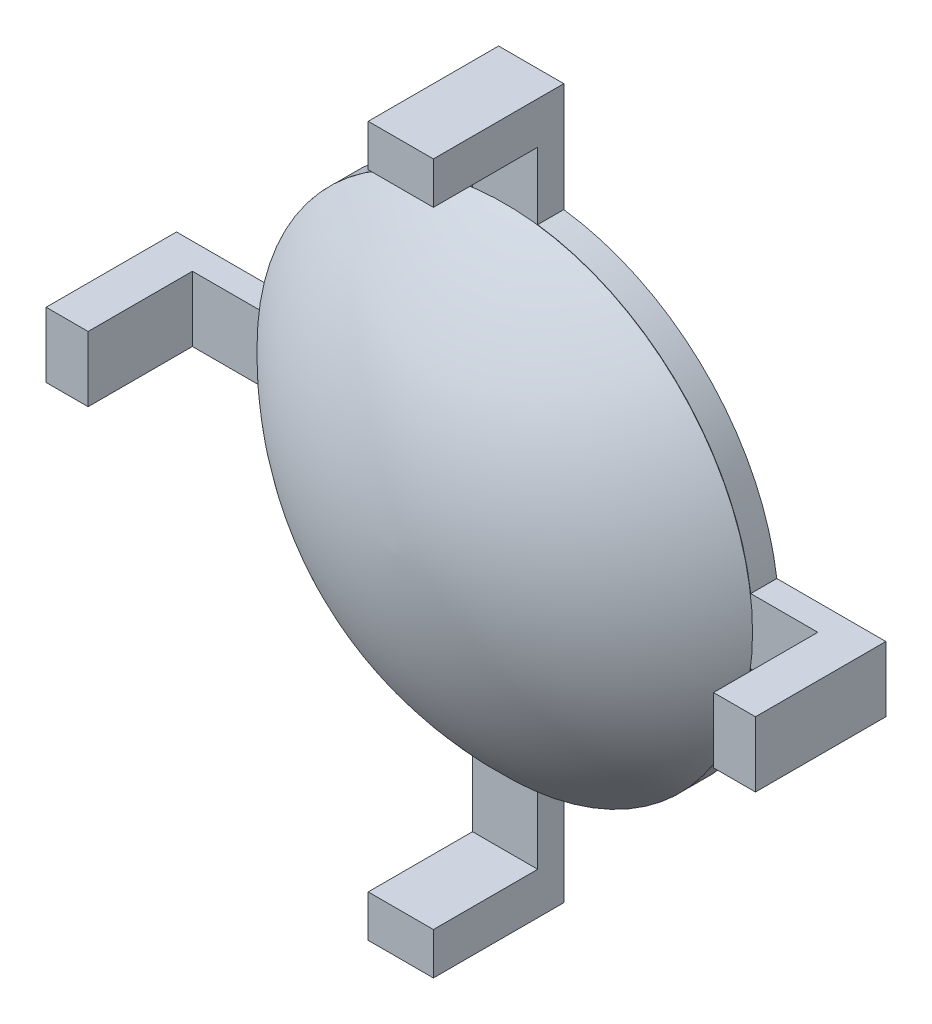
ISO-10303-21;
HEADER;
FILE_DESCRIPTION(('STEP AP214'),'2;1');
FILE_NAME('part.step','',(''),(''),'','','');
FILE_SCHEMA(('AUTOMOTIVE_DESIGN { 1 0 10303 214 1 1 1 1 }'));
ENDSEC;
DATA;
#1=APPLICATION_CONTEXT('core data for automotive mechanical design processes');
#2=APPLICATION_PROTOCOL_DEFINITION('international standard','automotive_design',2000,#1);
#3=PRODUCT_CONTEXT('',#1,'mechanical');
#4=PRODUCT('Part','Part','',(#3));
#5=PRODUCT_RELATED_PRODUCT_CATEGORY('part','',(#4));
#6=PRODUCT_DEFINITION_FORMATION('','',#4);
#7=PRODUCT_DEFINITION_CONTEXT('part definition',#1,'design');
#8=PRODUCT_DEFINITION('design','',#6,#7);
#9=PRODUCT_DEFINITION_SHAPE('','',#8);
#10=(LENGTH_UNIT() NAMED_UNIT(*) SI_UNIT(.MILLI.,.METRE.));
#11=(NAMED_UNIT(*) PLANE_ANGLE_UNIT() SI_UNIT($,.RADIAN.));
#12=(NAMED_UNIT(*) SI_UNIT($,.STERADIAN.) SOLID_ANGLE_UNIT());
#13=UNCERTAINTY_MEASURE_WITH_UNIT(LENGTH_MEASURE(1.E-05),#10,'distance_accuracy_value','');
#14=(GEOMETRIC_REPRESENTATION_CONTEXT(3) GLOBAL_UNCERTAINTY_ASSIGNED_CONTEXT((#13)) GLOBAL_UNIT_ASSIGNED_CONTEXT((#10,
#11,#12)) REPRESENTATION_CONTEXT('',''));
#15=CARTESIAN_POINT('',(0.,0.,0.));
#16=DIRECTION('',(0.,0.,1.));
#17=DIRECTION('',(1.,0.,0.));
#18=AXIS2_PLACEMENT_3D('',#15,#16,#17);
#19=CARTESIAN_POINT('',(0.,0.,1.01190134481042));
#20=DIRECTION('',(0.,0.,-1.));
#21=DIRECTION('',(-1.,0.,0.));
#22=AXIS2_PLACEMENT_3D('',#19,#20,#21);
#23=PLANE('',#22);
#24=CARTESIAN_POINT('',(-0.000156815590813585,0.,1.01190134481041));
#25=DIRECTION('',(0.,0.,-1.));
#26=DIRECTION('',(-1.,0.,0.));
#27=AXIS2_PLACEMENT_3D('',#24,#25,#26);
#28=CIRCLE('',#27,9.49999999999999);
#29=CARTESIAN_POINT('',(-9.5001568155908,0.,1.01190134481044));
#30=VERTEX_POINT('',#29);
#31=EDGE_CURVE('E13',#30,#30,#28,.T.);
#32=ORIENTED_EDGE('',*,*,#31,.T.);
#33=EDGE_LOOP('',(#32));
#34=FACE_BOUND('',#33,.T.);
#35=ADVANCED_FACE('F103',(#34),#23,.T.);
#36=CARTESIAN_POINT('',(0.321275749167376,0.,-8.35919612309495));
#37=DIRECTION('',(0.,-1.,0.));
#38=DIRECTION('',(-1.,0.,0.));
#39=AXIS2_PLACEMENT_3D('',#36,#37,#38);
#40=CIRCLE('',#39,13.5749035126249);
#41=TRIMMED_CURVE('',#40,(PARAMETER_VALUE(-1.54711567166305)),
(PARAMETER_VALUE(1.54711567166305)),.T.,.PARAMETER.);
#42=CARTESIAN_POINT('',(-0.000156815590845745,0.,-8.35919612309495));
#43=DIRECTION('',(0.,0.,-1.));
#44=AXIS1_PLACEMENT('',#42,#43);
#45=SURFACE_OF_REVOLUTION('',#41,#44);
#46=CARTESIAN_POINT('',(-0.000156815590799178,0.,5.21190134481044));
#47=VERTEX_POINT('',#46);
#48=VERTEX_LOOP('',#47);
#49=FACE_BOUND('',#48,.T.);
#50=ORIENTED_EDGE('',*,*,#31,.F.);
#51=EDGE_LOOP('',(#50));
#52=FACE_BOUND('',#51,.T.);
#53=ADVANCED_FACE('F111',(#49,#52),#45,.T.);
#54=CLOSED_SHELL('',(#35,#53));
#55=MANIFOLD_SOLID_BREP('B2',#54);
#56=CARTESIAN_POINT('',(0.,0.,1.));
#57=DIRECTION('',(0.,0.,1.));
#58=DIRECTION('',(1.,0.,0.));
#59=AXIS2_PLACEMENT_3D('',#56,#57,#58);
#60=PLANE('',#59);
#61=DIRECTION('',(0.,1.,0.));
#62=VECTOR('',#61,1.);
#63=CARTESIAN_POINT('',(-1.25000000000014,-13.6,1.));
#64=LINE('',#63,#62);
#65=CARTESIAN_POINT('',(-1.25000000000013,-11.9906023516351,1.));
#66=VERTEX_POINT('',#65);
#67=CARTESIAN_POINT('',(-1.2500000000001,-9.41740410091867,1.));
#68=VERTEX_POINT('',#67);
#69=EDGE_CURVE('E309',#66,#68,#64,.T.);
#70=ORIENTED_EDGE('',*,*,#69,.F.);
#71=DIRECTION('',(-1.,0.,0.));
#72=VECTOR('',#71,1.);
#73=CARTESIAN_POINT('',(-1.25000000000012,-11.9906023516351,1.));
#74=LINE('',#73,#72);
#75=CARTESIAN_POINT('',(1.24999999999988,-11.9906023516351,1.));
#76=VERTEX_POINT('',#75);
#77=EDGE_CURVE('E298',#76,#66,#74,.T.);
#78=ORIENTED_EDGE('',*,*,#77,.F.);
#79=DIRECTION('',(0.,1.,0.));
#80=VECTOR('',#79,1.);
#81=CARTESIAN_POINT('',(1.24999999999986,-13.6,1.));
#82=LINE('',#81,#80);
#83=CARTESIAN_POINT('',(1.2499999999999,-9.4174041009187,1.));
#84=VERTEX_POINT('',#83);
#85=EDGE_CURVE('E306',#76,#84,#82,.T.);
#86=ORIENTED_EDGE('',*,*,#85,.T.);
#87=CARTESIAN_POINT('',(0.,0.,1.));
#88=DIRECTION('',(0.,0.,1.));
#89=DIRECTION('',(1.,0.,0.));
#90=AXIS2_PLACEMENT_3D('',#87,#88,#89);
#91=CIRCLE('',#90,9.5);
#92=CARTESIAN_POINT('',(9.41740410091868,-1.25,1.));
#93=VERTEX_POINT('',#92);
#94=EDGE_CURVE('E351',#84,#93,#91,.T.);
#95=ORIENTED_EDGE('',*,*,#94,.T.);
#96=DIRECTION('',(1.,0.,0.));
#97=VECTOR('',#96,1.);
#98=CARTESIAN_POINT('',(0.,-1.25,1.));
#99=LINE('',#98,#97);
#100=CARTESIAN_POINT('',(11.9906023516351,-1.25,1.));
#101=VERTEX_POINT('',#100);
#102=EDGE_CURVE('E387',#93,#101,#99,.T.);
#103=ORIENTED_EDGE('',*,*,#102,.T.);
#104=DIRECTION('',(0.,-1.,0.));
#105=VECTOR('',#104,1.);
#106=CARTESIAN_POINT('',(11.9906023516351,-1.25000000000008,1.));
#107=LINE('',#106,#105);
#108=CARTESIAN_POINT('',(11.9906023516351,1.25,1.));
#109=VERTEX_POINT('',#108);
#110=EDGE_CURVE('E156',#109,#101,#107,.T.);
#111=ORIENTED_EDGE('',*,*,#110,.F.);
#112=DIRECTION('',(1.,0.,0.));
#113=VECTOR('',#112,1.);
#114=CARTESIAN_POINT('',(0.,1.25,1.));
#115=LINE('',#114,#113);
#116=CARTESIAN_POINT('',(9.41740410091868,1.25,1.));
#117=VERTEX_POINT('',#116);
#118=EDGE_CURVE('E382',#117,#109,#115,.T.);
#119=ORIENTED_EDGE('',*,*,#118,.F.);
#120=CARTESIAN_POINT('',(1.2500000000001,9.41740410091867,1.));
#121=VERTEX_POINT('',#120);
#122=EDGE_CURVE('E354',#117,#121,#91,.T.);
#123=ORIENTED_EDGE('',*,*,#122,.T.);
#124=CARTESIAN_POINT('',(1.25000000000004,11.9906023516351,1.));
#125=VERTEX_POINT('',#124);
#126=EDGE_CURVE('E318',#121,#125,#82,.T.);
#127=ORIENTED_EDGE('',*,*,#126,.T.);
#128=DIRECTION('',(1.,0.,0.));
#129=VECTOR('',#128,1.);
#130=CARTESIAN_POINT('',(1.25000000000004,11.9906023516351,1.));
#131=LINE('',#130,#129);
#132=CARTESIAN_POINT('',(-1.24999999999996,11.9906023516351,1.));
#133=VERTEX_POINT('',#132);
#134=EDGE_CURVE('E451',#133,#125,#131,.T.);
#135=ORIENTED_EDGE('',*,*,#134,.F.);
#136=CARTESIAN_POINT('',(-1.2499999999999,9.4174041009187,1.));
#137=VERTEX_POINT('',#136);
#138=EDGE_CURVE('E317',#137,#133,#64,.T.);
#139=ORIENTED_EDGE('',*,*,#138,.F.);
#140=CARTESIAN_POINT('',(-9.41740410091868,1.25,1.));
#141=VERTEX_POINT('',#140);
#142=EDGE_CURVE('E355',#137,#141,#91,.T.);
#143=ORIENTED_EDGE('',*,*,#142,.T.);
#144=DIRECTION('',(1.,0.,0.));
#145=VECTOR('',#144,1.);
#146=CARTESIAN_POINT('',(0.,1.25,1.));
#147=LINE('',#146,#145);
#148=CARTESIAN_POINT('',(-11.9906023516351,1.25,1.));
#149=VERTEX_POINT('',#148);
#150=EDGE_CURVE('E412',#149,#141,#147,.T.);
#151=ORIENTED_EDGE('',*,*,#150,.F.);
#152=DIRECTION('',(0.,1.,0.));
#153=VECTOR('',#152,1.);
#154=CARTESIAN_POINT('',(-11.9906023516351,1.25,1.));
#155=LINE('',#154,#153);
#156=CARTESIAN_POINT('',(-11.9906023516351,-1.25,1.));
#157=VERTEX_POINT('',#156);
#158=EDGE_CURVE('E453',#157,#149,#155,.T.);
#159=ORIENTED_EDGE('',*,*,#158,.F.);
#160=DIRECTION('',(1.,0.,0.));
#161=VECTOR('',#160,1.);
#162=CARTESIAN_POINT('',(0.,-1.25,1.));
#163=LINE('',#162,#161);
#164=CARTESIAN_POINT('',(-9.41740410091868,-1.25,1.));
#165=VERTEX_POINT('',#164);
#166=EDGE_CURVE('E407',#157,#165,#163,.T.);
#167=ORIENTED_EDGE('',*,*,#166,.T.);
#168=EDGE_CURVE('E353',#165,#68,#91,.T.);
#169=ORIENTED_EDGE('',*,*,#168,.T.);
#170=EDGE_LOOP('',(#70,#78,#86,#95,#103,#111,#119,#123,#127,#135,#139,#143,#151,#159,#167,#169));
#171=FACE_BOUND('',#170,.T.);
#172=ADVANCED_FACE('F131',(#171),#60,.T.);
#173=CARTESIAN_POINT('',(0.,1.25,1.));
#174=DIRECTION('',(0.,1.,0.));
#175=DIRECTION('',(-1.,0.,0.));
#176=AXIS2_PLACEMENT_3D('',#173,#174,#175);
#177=PLANE('',#176);
#178=DIRECTION('',(1.,0.,0.));
#179=VECTOR('',#178,1.);
#180=CARTESIAN_POINT('',(0.,1.25,0.));
#181=LINE('',#180,#179);
#182=CARTESIAN_POINT('',(-13.6,1.25,0.));
#183=VERTEX_POINT('',#182);
#184=CARTESIAN_POINT('',(-9.41740410091868,1.25,0.));
#185=VERTEX_POINT('',#184);
#186=EDGE_CURVE('E395',#183,#185,#181,.T.);
#187=ORIENTED_EDGE('',*,*,#186,.F.);
#188=DIRECTION('',(0.,0.,-1.));
#189=VECTOR('',#188,1.);
#190=CARTESIAN_POINT('',(-13.6,1.25,1.));
#191=LINE('',#190,#189);
#192=CARTESIAN_POINT('',(-13.6,1.25,5.));
#193=VERTEX_POINT('',#192);
#194=EDGE_CURVE('E140',#193,#183,#191,.T.);
#195=ORIENTED_EDGE('',*,*,#194,.F.);
#196=DIRECTION('',(-1.,0.,0.));
#197=VECTOR('',#196,1.);
#198=CARTESIAN_POINT('',(-13.6,1.25,5.));
#199=LINE('',#198,#197);
#200=CARTESIAN_POINT('',(-11.9906023516351,1.25,5.));
#201=VERTEX_POINT('',#200);
#202=EDGE_CURVE('E470',#201,#193,#199,.T.);
#203=ORIENTED_EDGE('',*,*,#202,.F.);
#204=DIRECTION('',(0.,0.,-1.));
#205=VECTOR('',#204,1.);
#206=CARTESIAN_POINT('',(-11.9906023516351,1.25,5.));
#207=LINE('',#206,#205);
#208=EDGE_CURVE('E473',#201,#149,#207,.T.);
#209=ORIENTED_EDGE('',*,*,#208,.T.);
#210=ORIENTED_EDGE('',*,*,#150,.T.);
#211=DIRECTION('',(0.,0.,-1.));
#212=VECTOR('',#211,1.);
#213=CARTESIAN_POINT('',(-9.41740410091868,1.25,1.));
#214=LINE('',#213,#212);
#215=EDGE_CURVE('E101',#141,#185,#214,.T.);
#216=ORIENTED_EDGE('',*,*,#215,.T.);
#217=EDGE_LOOP('',(#187,#195,#203,#209,#210,#216));
#218=FACE_BOUND('',#217,.T.);
#219=ADVANCED_FACE('F526',(#218),#177,.T.);
#220=CARTESIAN_POINT('',(-13.6,0.,1.));
#221=DIRECTION('',(-1.,0.,0.));
#222=DIRECTION('',(0.,0.,1.));
#223=AXIS2_PLACEMENT_3D('',#220,#221,#222);
#224=PLANE('',#223);
#225=DIRECTION('',(0.,1.,0.));
#226=VECTOR('',#225,1.);
#227=CARTESIAN_POINT('',(-13.6,0.,0.));
#228=LINE('',#227,#226);
#229=CARTESIAN_POINT('',(-13.6,-1.25,0.));
#230=VERTEX_POINT('',#229);
#231=EDGE_CURVE('E398',#230,#183,#228,.T.);
#232=ORIENTED_EDGE('',*,*,#231,.F.);
#233=DIRECTION('',(0.,0.,-1.));
#234=VECTOR('',#233,1.);
#235=CARTESIAN_POINT('',(-13.6,-1.25,1.));
#236=LINE('',#235,#234);
#237=CARTESIAN_POINT('',(-13.6,-1.25,5.));
#238=VERTEX_POINT('',#237);
#239=EDGE_CURVE('E415',#238,#230,#236,.T.);
#240=ORIENTED_EDGE('',*,*,#239,.F.);
#241=DIRECTION('',(0.,-1.,0.));
#242=VECTOR('',#241,1.);
#243=CARTESIAN_POINT('',(-13.6,1.25,5.));
#244=LINE('',#243,#242);
#245=EDGE_CURVE('E463',#193,#238,#244,.T.);
#246=ORIENTED_EDGE('',*,*,#245,.F.);
#247=ORIENTED_EDGE('',*,*,#194,.T.);
#248=EDGE_LOOP('',(#232,#240,#246,#247));
#249=FACE_BOUND('',#248,.T.);
#250=ADVANCED_FACE('F532',(#249),#224,.T.);
#251=CARTESIAN_POINT('',(0.,-1.25,1.));
#252=DIRECTION('',(0.,1.,0.));
#253=DIRECTION('',(-1.,0.,0.));
#254=AXIS2_PLACEMENT_3D('',#251,#252,#253);
#255=PLANE('',#254);
#256=DIRECTION('',(1.,0.,0.));
#257=VECTOR('',#256,1.);
#258=CARTESIAN_POINT('',(0.,-1.25,0.));
#259=LINE('',#258,#257);
#260=CARTESIAN_POINT('',(-9.41740410091868,-1.25,0.));
#261=VERTEX_POINT('',#260);
#262=EDGE_CURVE('E404',#230,#261,#259,.T.);
#263=ORIENTED_EDGE('',*,*,#262,.T.);
#264=DIRECTION('',(0.,0.,-1.));
#265=VECTOR('',#264,1.);
#266=CARTESIAN_POINT('',(-9.41740410091868,-1.25,1.));
#267=LINE('',#266,#265);
#268=EDGE_CURVE('E413',#165,#261,#267,.T.);
#269=ORIENTED_EDGE('',*,*,#268,.F.);
#270=ORIENTED_EDGE('',*,*,#166,.F.);
#271=DIRECTION('',(0.,0.,-1.));
#272=VECTOR('',#271,1.);
#273=CARTESIAN_POINT('',(-11.9906023516351,-1.25,5.));
#274=LINE('',#273,#272);
#275=CARTESIAN_POINT('',(-11.9906023516351,-1.25,5.));
#276=VERTEX_POINT('',#275);
#277=EDGE_CURVE('E478',#276,#157,#274,.T.);
#278=ORIENTED_EDGE('',*,*,#277,.F.);
#279=DIRECTION('',(1.,0.,0.));
#280=VECTOR('',#279,1.);
#281=CARTESIAN_POINT('',(-13.6,-1.25,5.));
#282=LINE('',#281,#280);
#283=EDGE_CURVE('E466',#238,#276,#282,.T.);
#284=ORIENTED_EDGE('',*,*,#283,.F.);
#285=ORIENTED_EDGE('',*,*,#239,.T.);
#286=EDGE_LOOP('',(#263,#269,#270,#278,#284,#285));
#287=FACE_BOUND('',#286,.T.);
#288=ADVANCED_FACE('F488',(#287),#255,.F.);
#289=CARTESIAN_POINT('',(0.,0.,0.));
#290=DIRECTION('',(0.,0.,1.));
#291=DIRECTION('',(1.,0.,0.));
#292=AXIS2_PLACEMENT_3D('',#289,#290,#291);
#293=PLANE('',#292);
#294=ORIENTED_EDGE('',*,*,#186,.T.);
#295=CARTESIAN_POINT('',(0.,0.,0.));
#296=DIRECTION('',(0.,0.,1.));
#297=DIRECTION('',(1.,0.,0.));
#298=AXIS2_PLACEMENT_3D('',#295,#296,#297);
#299=CIRCLE('',#298,9.5);
#300=CARTESIAN_POINT('',(-1.2499999999999,9.4174041009187,0.));
#301=VERTEX_POINT('',#300);
#302=EDGE_CURVE('E361',#301,#185,#299,.T.);
#303=ORIENTED_EDGE('',*,*,#302,.F.);
#304=DIRECTION('',(0.,1.,0.));
#305=VECTOR('',#304,1.);
#306=CARTESIAN_POINT('',(-1.25000000000014,-13.6,0.));
#307=LINE('',#306,#305);
#308=CARTESIAN_POINT('',(-1.24999999999986,13.6,0.));
#309=VERTEX_POINT('',#308);
#310=EDGE_CURVE('E335',#301,#309,#307,.T.);
#311=ORIENTED_EDGE('',*,*,#310,.T.);
#312=DIRECTION('',(-1.,0.,0.));
#313=VECTOR('',#312,1.);
#314=CARTESIAN_POINT('',(1.25000000000014,13.6,0.));
#315=LINE('',#314,#313);
#316=CARTESIAN_POINT('',(1.25000000000014,13.6,0.));
#317=VERTEX_POINT('',#316);
#318=EDGE_CURVE('E331',#317,#309,#315,.T.);
#319=ORIENTED_EDGE('',*,*,#318,.F.);
#320=DIRECTION('',(0.,1.,0.));
#321=VECTOR('',#320,1.);
#322=CARTESIAN_POINT('',(1.24999999999986,-13.6,0.));
#323=LINE('',#322,#321);
#324=CARTESIAN_POINT('',(1.2500000000001,9.41740410091867,0.));
#325=VERTEX_POINT('',#324);
#326=EDGE_CURVE('E332',#325,#317,#323,.T.);
#327=ORIENTED_EDGE('',*,*,#326,.F.);
#328=CARTESIAN_POINT('',(9.41740410091868,1.25,0.));
#329=VERTEX_POINT('',#328);
#330=EDGE_CURVE('E360',#329,#325,#299,.T.);
#331=ORIENTED_EDGE('',*,*,#330,.F.);
#332=DIRECTION('',(1.,0.,0.));
#333=VECTOR('',#332,1.);
#334=CARTESIAN_POINT('',(0.,1.25,0.));
#335=LINE('',#334,#333);
#336=CARTESIAN_POINT('',(13.6,1.25,0.));
#337=VERTEX_POINT('',#336);
#338=EDGE_CURVE('E379',#329,#337,#335,.T.);
#339=ORIENTED_EDGE('',*,*,#338,.T.);
#340=DIRECTION('',(0.,1.,0.));
#341=VECTOR('',#340,1.);
#342=CARTESIAN_POINT('',(13.6,0.,0.));
#343=LINE('',#342,#341);
#344=CARTESIAN_POINT('',(13.6,-1.25,0.));
#345=VERTEX_POINT('',#344);
#346=EDGE_CURVE('E373',#345,#337,#343,.T.);
#347=ORIENTED_EDGE('',*,*,#346,.F.);
#348=DIRECTION('',(1.,0.,0.));
#349=VECTOR('',#348,1.);
#350=CARTESIAN_POINT('',(0.,-1.25,0.));
#351=LINE('',#350,#349);
#352=CARTESIAN_POINT('',(9.41740410091868,-1.25,0.));
#353=VERTEX_POINT('',#352);
#354=EDGE_CURVE('E368',#353,#345,#351,.T.);
#355=ORIENTED_EDGE('',*,*,#354,.F.);
#356=CARTESIAN_POINT('',(1.2499999999999,-9.4174041009187,0.));
#357=VERTEX_POINT('',#356);
#358=EDGE_CURVE('E356',#357,#353,#299,.T.);
#359=ORIENTED_EDGE('',*,*,#358,.F.);
#360=CARTESIAN_POINT('',(1.24999999999986,-13.6,0.));
#361=VERTEX_POINT('',#360);
#362=EDGE_CURVE('E329',#361,#357,#323,.T.);
#363=ORIENTED_EDGE('',*,*,#362,.F.);
#364=DIRECTION('',(-1.,0.,0.));
#365=VECTOR('',#364,1.);
#366=CARTESIAN_POINT('',(1.24999999999986,-13.6,0.));
#367=LINE('',#366,#365);
#368=CARTESIAN_POINT('',(-1.25000000000014,-13.6,0.));
#369=VERTEX_POINT('',#368);
#370=EDGE_CURVE('E323',#361,#369,#367,.T.);
#371=ORIENTED_EDGE('',*,*,#370,.T.);
#372=CARTESIAN_POINT('',(-1.2500000000001,-9.41740410091867,0.));
#373=VERTEX_POINT('',#372);
#374=EDGE_CURVE('E336',#369,#373,#307,.T.);
#375=ORIENTED_EDGE('',*,*,#374,.T.);
#376=EDGE_CURVE('E359',#261,#373,#299,.T.);
#377=ORIENTED_EDGE('',*,*,#376,.F.);
#378=ORIENTED_EDGE('',*,*,#262,.F.);
#379=ORIENTED_EDGE('',*,*,#231,.T.);
#380=EDGE_LOOP('',(#294,#303,#311,#319,#327,#331,#339,#347,#355,#359,#363,#371,#375,#377,#378,#379));
#381=FACE_BOUND('',#380,.T.);
#382=ADVANCED_FACE('F502',(#381),#293,.F.);
#383=CARTESIAN_POINT('',(13.6,0.,1.));
#384=DIRECTION('',(-1.,0.,0.));
#385=DIRECTION('',(0.,0.,1.));
#386=AXIS2_PLACEMENT_3D('',#383,#384,#385);
#387=PLANE('',#386);
#388=ORIENTED_EDGE('',*,*,#346,.T.);
#389=DIRECTION('',(0.,0.,-1.));
#390=VECTOR('',#389,1.);
#391=CARTESIAN_POINT('',(13.6,1.25,1.));
#392=LINE('',#391,#390);
#393=CARTESIAN_POINT('',(13.6,1.24999999999991,5.));
#394=VERTEX_POINT('',#393);
#395=EDGE_CURVE('E390',#394,#337,#392,.T.);
#396=ORIENTED_EDGE('',*,*,#395,.F.);
#397=DIRECTION('',(0.,1.,0.));
#398=VECTOR('',#397,1.);
#399=CARTESIAN_POINT('',(13.6,-1.25000000000009,5.));
#400=LINE('',#399,#398);
#401=CARTESIAN_POINT('',(13.6,-1.25000000000009,5.));
#402=VERTEX_POINT('',#401);
#403=EDGE_CURVE('E441',#402,#394,#400,.T.);
#404=ORIENTED_EDGE('',*,*,#403,.F.);
#405=DIRECTION('',(0.,0.,-1.));
#406=VECTOR('',#405,1.);
#407=CARTESIAN_POINT('',(13.6,-1.25,1.));
#408=LINE('',#407,#406);
#409=EDGE_CURVE('E391',#402,#345,#408,.T.);
#410=ORIENTED_EDGE('',*,*,#409,.T.);
#411=EDGE_LOOP('',(#388,#396,#404,#410));
#412=FACE_BOUND('',#411,.T.);
#413=ADVANCED_FACE('F569',(#412),#387,.F.);
#414=CARTESIAN_POINT('',(0.,1.25,1.));
#415=DIRECTION('',(0.,1.,0.));
#416=DIRECTION('',(-1.,0.,0.));
#417=AXIS2_PLACEMENT_3D('',#414,#415,#416);
#418=PLANE('',#417);
#419=ORIENTED_EDGE('',*,*,#338,.F.);
#420=DIRECTION('',(0.,0.,-1.));
#421=VECTOR('',#420,1.);
#422=CARTESIAN_POINT('',(9.41740410091868,1.25,1.));
#423=LINE('',#422,#421);
#424=EDGE_CURVE('E388',#117,#329,#423,.T.);
#425=ORIENTED_EDGE('',*,*,#424,.F.);
#426=ORIENTED_EDGE('',*,*,#118,.T.);
#427=DIRECTION('',(0.,0.,-1.));
#428=VECTOR('',#427,1.);
#429=CARTESIAN_POINT('',(11.9906023516351,1.24999999999992,5.));
#430=LINE('',#429,#428);
#431=CARTESIAN_POINT('',(11.9906023516351,1.24999999999992,5.));
#432=VERTEX_POINT('',#431);
#433=EDGE_CURVE('E310',#432,#109,#430,.T.);
#434=ORIENTED_EDGE('',*,*,#433,.F.);
#435=DIRECTION('',(-1.,0.,0.));
#436=VECTOR('',#435,1.);
#437=CARTESIAN_POINT('',(13.6,1.24999999999991,5.));
#438=LINE('',#437,#436);
#439=EDGE_CURVE('E439',#394,#432,#438,.T.);
#440=ORIENTED_EDGE('',*,*,#439,.F.);
#441=ORIENTED_EDGE('',*,*,#395,.T.);
#442=EDGE_LOOP('',(#419,#425,#426,#434,#440,#441));
#443=FACE_BOUND('',#442,.T.);
#444=ADVANCED_FACE('F421',(#443),#418,.T.);
#445=CARTESIAN_POINT('',(0.,-1.25,1.));
#446=DIRECTION('',(0.,1.,0.));
#447=DIRECTION('',(-1.,0.,0.));
#448=AXIS2_PLACEMENT_3D('',#445,#446,#447);
#449=PLANE('',#448);
#450=ORIENTED_EDGE('',*,*,#354,.T.);
#451=ORIENTED_EDGE('',*,*,#409,.F.);
#452=DIRECTION('',(1.,0.,0.));
#453=VECTOR('',#452,1.);
#454=CARTESIAN_POINT('',(13.6,-1.25000000000009,5.));
#455=LINE('',#454,#453);
#456=CARTESIAN_POINT('',(11.9906023516351,-1.25000000000008,5.));
#457=VERTEX_POINT('',#456);
#458=EDGE_CURVE('E437',#457,#402,#455,.T.);
#459=ORIENTED_EDGE('',*,*,#458,.F.);
#460=DIRECTION('',(0.,0.,-1.));
#461=VECTOR('',#460,1.);
#462=CARTESIAN_POINT('',(11.9906023516351,-1.25000000000008,5.));
#463=LINE('',#462,#461);
#464=EDGE_CURVE('E429',#457,#101,#463,.T.);
#465=ORIENTED_EDGE('',*,*,#464,.T.);
#466=ORIENTED_EDGE('',*,*,#102,.F.);
#467=DIRECTION('',(0.,0.,-1.));
#468=VECTOR('',#467,1.);
#469=CARTESIAN_POINT('',(9.41740410091868,-1.25,1.));
#470=LINE('',#469,#468);
#471=EDGE_CURVE('E325',#93,#353,#470,.T.);
#472=ORIENTED_EDGE('',*,*,#471,.T.);
#473=EDGE_LOOP('',(#450,#451,#459,#465,#466,#472));
#474=FACE_BOUND('',#473,.T.);
#475=ADVANCED_FACE('F572',(#474),#449,.F.);
#476=CARTESIAN_POINT('',(1.24999999999986,-13.6,1.));
#477=DIRECTION('',(-1.,0.,0.));
#478=DIRECTION('',(0.,-1.,0.));
#479=AXIS2_PLACEMENT_3D('',#476,#477,#478);
#480=PLANE('',#479);
#481=DIRECTION('',(0.,0.,-1.));
#482=VECTOR('',#481,1.);
#483=CARTESIAN_POINT('',(1.2500000000001,9.41740410091867,1.));
#484=LINE('',#483,#482);
#485=EDGE_CURVE('E135',#325,#121,#484,.F.);
#486=ORIENTED_EDGE('',*,*,#485,.F.);
#487=ORIENTED_EDGE('',*,*,#326,.T.);
#488=DIRECTION('',(0.,0.,-1.));
#489=VECTOR('',#488,1.);
#490=CARTESIAN_POINT('',(1.25000000000014,13.6,1.));
#491=LINE('',#490,#489);
#492=CARTESIAN_POINT('',(1.25000000000005,13.6,5.));
#493=VERTEX_POINT('',#492);
#494=EDGE_CURVE('E347',#493,#317,#491,.T.);
#495=ORIENTED_EDGE('',*,*,#494,.F.);
#496=DIRECTION('',(0.,1.,0.));
#497=VECTOR('',#496,1.);
#498=CARTESIAN_POINT('',(1.25000000000005,13.6,5.));
#499=LINE('',#498,#497);
#500=CARTESIAN_POINT('',(1.25000000000004,11.9906023516351,5.));
#501=VERTEX_POINT('',#500);
#502=EDGE_CURVE('E454',#501,#493,#499,.T.);
#503=ORIENTED_EDGE('',*,*,#502,.F.);
#504=DIRECTION('',(0.,0.,-1.));
#505=VECTOR('',#504,1.);
#506=CARTESIAN_POINT('',(1.25000000000004,11.9906023516351,5.));
#507=LINE('',#506,#505);
#508=EDGE_CURVE('E447',#501,#125,#507,.T.);
#509=ORIENTED_EDGE('',*,*,#508,.T.);
#510=ORIENTED_EDGE('',*,*,#126,.F.);
#511=EDGE_LOOP('',(#486,#487,#495,#503,#509,#510));
#512=FACE_BOUND('',#511,.T.);
#513=ADVANCED_FACE('F500',(#512),#480,.F.);
#514=DIRECTION('',(0.,0.,-1.));
#515=VECTOR('',#514,1.);
#516=CARTESIAN_POINT('',(1.2499999999999,-9.4174041009187,1.));
#517=LINE('',#516,#515);
#518=EDGE_CURVE('E315',#84,#357,#517,.T.);
#519=ORIENTED_EDGE('',*,*,#518,.F.);
#520=ORIENTED_EDGE('',*,*,#85,.F.);
#521=DIRECTION('',(0.,0.,-1.));
#522=VECTOR('',#521,1.);
#523=CARTESIAN_POINT('',(1.24999999999988,-11.9906023516351,5.));
#524=LINE('',#523,#522);
#525=CARTESIAN_POINT('',(1.24999999999988,-11.9906023516351,5.));
#526=VERTEX_POINT('',#525);
#527=EDGE_CURVE('E295',#526,#76,#524,.T.);
#528=ORIENTED_EDGE('',*,*,#527,.F.);
#529=DIRECTION('',(0.,1.,0.));
#530=VECTOR('',#529,1.);
#531=CARTESIAN_POINT('',(1.24999999999986,-13.6,5.));
#532=LINE('',#531,#530);
#533=CARTESIAN_POINT('',(1.24999999999986,-13.6,5.));
#534=VERTEX_POINT('',#533);
#535=EDGE_CURVE('E545',#534,#526,#532,.T.);
#536=ORIENTED_EDGE('',*,*,#535,.F.);
#537=DIRECTION('',(0.,0.,-1.));
#538=VECTOR('',#537,1.);
#539=CARTESIAN_POINT('',(1.24999999999986,-13.6,1.));
#540=LINE('',#539,#538);
#541=EDGE_CURVE('E328',#534,#361,#540,.T.);
#542=ORIENTED_EDGE('',*,*,#541,.T.);
#543=ORIENTED_EDGE('',*,*,#362,.T.);
#544=EDGE_LOOP('',(#519,#520,#528,#536,#542,#543));
#545=FACE_BOUND('',#544,.T.);
#546=ADVANCED_FACE('F313',(#545),#480,.F.);
#547=CARTESIAN_POINT('',(0.,0.,1.));
#548=DIRECTION('',(0.,0.,-1.));
#549=DIRECTION('',(-1.,0.,0.));
#550=AXIS2_PLACEMENT_3D('',#547,#548,#549);
#551=CYLINDRICAL_SURFACE('',#550,9.5);
#552=ORIENTED_EDGE('',*,*,#424,.T.);
#553=ORIENTED_EDGE('',*,*,#330,.T.);
#554=ORIENTED_EDGE('',*,*,#485,.T.);
#555=ORIENTED_EDGE('',*,*,#122,.F.);
#556=EDGE_LOOP('',(#552,#553,#554,#555));
#557=FACE_BOUND('',#556,.T.);
#558=ADVANCED_FACE('F497',(#557),#551,.T.);
#559=ORIENTED_EDGE('',*,*,#358,.T.);
#560=ORIENTED_EDGE('',*,*,#471,.F.);
#561=ORIENTED_EDGE('',*,*,#94,.F.);
#562=ORIENTED_EDGE('',*,*,#518,.T.);
#563=EDGE_LOOP('',(#559,#560,#561,#562));
#564=FACE_BOUND('',#563,.T.);
#565=ADVANCED_FACE('F573',(#564),#551,.T.);
#566=CARTESIAN_POINT('',(1.25000000000014,13.6,1.));
#567=DIRECTION('',(0.,-1.,0.));
#568=DIRECTION('',(1.,0.,0.));
#569=AXIS2_PLACEMENT_3D('',#566,#567,#568);
#570=PLANE('',#569);
#571=ORIENTED_EDGE('',*,*,#318,.T.);
#572=DIRECTION('',(0.,0.,-1.));
#573=VECTOR('',#572,1.);
#574=CARTESIAN_POINT('',(-1.24999999999986,13.6,1.));
#575=LINE('',#574,#573);
#576=CARTESIAN_POINT('',(-1.24999999999995,13.6,5.));
#577=VERTEX_POINT('',#576);
#578=EDGE_CURVE('E344',#577,#309,#575,.T.);
#579=ORIENTED_EDGE('',*,*,#578,.F.);
#580=DIRECTION('',(-1.,0.,0.));
#581=VECTOR('',#580,1.);
#582=CARTESIAN_POINT('',(1.25000000000005,13.6,5.));
#583=LINE('',#582,#581);
#584=EDGE_CURVE('E458',#493,#577,#583,.T.);
#585=ORIENTED_EDGE('',*,*,#584,.F.);
#586=ORIENTED_EDGE('',*,*,#494,.T.);
#587=EDGE_LOOP('',(#571,#579,#585,#586));
#588=FACE_BOUND('',#587,.T.);
#589=ADVANCED_FACE('F506',(#588),#570,.F.);
#590=CARTESIAN_POINT('',(1.24999999999986,-13.6,1.));
#591=DIRECTION('',(0.,-1.,0.));
#592=DIRECTION('',(1.,0.,0.));
#593=AXIS2_PLACEMENT_3D('',#590,#591,#592);
#594=PLANE('',#593);
#595=ORIENTED_EDGE('',*,*,#370,.F.);
#596=ORIENTED_EDGE('',*,*,#541,.F.);
#597=DIRECTION('',(1.,0.,0.));
#598=VECTOR('',#597,1.);
#599=CARTESIAN_POINT('',(-1.25000000000014,-13.6,5.));
#600=LINE('',#599,#598);
#601=CARTESIAN_POINT('',(-1.25000000000014,-13.6,5.));
#602=VERTEX_POINT('',#601);
#603=EDGE_CURVE('E542',#602,#534,#600,.T.);
#604=ORIENTED_EDGE('',*,*,#603,.F.);
#605=DIRECTION('',(0.,0.,-1.));
#606=VECTOR('',#605,1.);
#607=CARTESIAN_POINT('',(-1.25000000000014,-13.6,1.));
#608=LINE('',#607,#606);
#609=EDGE_CURVE('E342',#602,#369,#608,.T.);
#610=ORIENTED_EDGE('',*,*,#609,.T.);
#611=EDGE_LOOP('',(#595,#596,#604,#610));
#612=FACE_BOUND('',#611,.T.);
#613=ADVANCED_FACE('F540',(#612),#594,.T.);
#614=CARTESIAN_POINT('',(-1.25000000000014,-13.6,1.));
#615=DIRECTION('',(-1.,0.,0.));
#616=DIRECTION('',(0.,-1.,0.));
#617=AXIS2_PLACEMENT_3D('',#614,#615,#616);
#618=PLANE('',#617);
#619=ORIENTED_EDGE('',*,*,#310,.F.);
#620=DIRECTION('',(0.,0.,-1.));
#621=VECTOR('',#620,1.);
#622=CARTESIAN_POINT('',(-1.2499999999999,9.4174041009187,1.));
#623=LINE('',#622,#621);
#624=EDGE_CURVE('E364',#301,#137,#623,.F.);
#625=ORIENTED_EDGE('',*,*,#624,.T.);
#626=ORIENTED_EDGE('',*,*,#138,.T.);
#627=DIRECTION('',(0.,0.,-1.));
#628=VECTOR('',#627,1.);
#629=CARTESIAN_POINT('',(-1.24999999999996,11.9906023516351,5.));
#630=LINE('',#629,#628);
#631=CARTESIAN_POINT('',(-1.24999999999996,11.9906023516351,5.));
#632=VERTEX_POINT('',#631);
#633=EDGE_CURVE('E436',#632,#133,#630,.T.);
#634=ORIENTED_EDGE('',*,*,#633,.F.);
#635=DIRECTION('',(0.,-1.,0.));
#636=VECTOR('',#635,1.);
#637=CARTESIAN_POINT('',(-1.24999999999995,13.6,5.));
#638=LINE('',#637,#636);
#639=EDGE_CURVE('E456',#577,#632,#638,.T.);
#640=ORIENTED_EDGE('',*,*,#639,.F.);
#641=ORIENTED_EDGE('',*,*,#578,.T.);
#642=EDGE_LOOP('',(#619,#625,#626,#634,#640,#641));
#643=FACE_BOUND('',#642,.T.);
#644=ADVANCED_FACE('F519',(#643),#618,.T.);
#645=ORIENTED_EDGE('',*,*,#609,.F.);
#646=DIRECTION('',(0.,-1.,0.));
#647=VECTOR('',#646,1.);
#648=CARTESIAN_POINT('',(-1.25000000000014,-13.6,5.));
#649=LINE('',#648,#647);
#650=CARTESIAN_POINT('',(-1.25000000000012,-11.9906023516351,5.));
#651=VERTEX_POINT('',#650);
#652=EDGE_CURVE('E311',#651,#602,#649,.T.);
#653=ORIENTED_EDGE('',*,*,#652,.F.);
#654=DIRECTION('',(0.,0.,-1.));
#655=VECTOR('',#654,1.);
#656=CARTESIAN_POINT('',(-1.25000000000012,-11.9906023516351,5.));
#657=LINE('',#656,#655);
#658=EDGE_CURVE('E148',#651,#66,#657,.T.);
#659=ORIENTED_EDGE('',*,*,#658,.T.);
#660=ORIENTED_EDGE('',*,*,#69,.T.);
#661=DIRECTION('',(0.,0.,-1.));
#662=VECTOR('',#661,1.);
#663=CARTESIAN_POINT('',(-1.2500000000001,-9.41740410091867,1.));
#664=LINE('',#663,#662);
#665=EDGE_CURVE('E350',#68,#373,#664,.T.);
#666=ORIENTED_EDGE('',*,*,#665,.T.);
#667=ORIENTED_EDGE('',*,*,#374,.F.);
#668=EDGE_LOOP('',(#645,#653,#659,#660,#666,#667));
#669=FACE_BOUND('',#668,.T.);
#670=ADVANCED_FACE('F535',(#669),#618,.T.);
#671=ORIENTED_EDGE('',*,*,#215,.F.);
#672=ORIENTED_EDGE('',*,*,#142,.F.);
#673=ORIENTED_EDGE('',*,*,#624,.F.);
#674=ORIENTED_EDGE('',*,*,#302,.T.);
#675=EDGE_LOOP('',(#671,#672,#673,#674));
#676=FACE_BOUND('',#675,.T.);
#677=ADVANCED_FACE('F133',(#676),#551,.T.);
#678=ORIENTED_EDGE('',*,*,#168,.F.);
#679=ORIENTED_EDGE('',*,*,#268,.T.);
#680=ORIENTED_EDGE('',*,*,#376,.T.);
#681=ORIENTED_EDGE('',*,*,#665,.F.);
#682=EDGE_LOOP('',(#678,#679,#680,#681));
#683=FACE_BOUND('',#682,.T.);
#684=ADVANCED_FACE('F492',(#683),#551,.T.);
#685=CARTESIAN_POINT('',(-11.9906023516351,1.25,5.));
#686=DIRECTION('',(-1.,0.,0.));
#687=DIRECTION('',(0.,0.,1.));
#688=AXIS2_PLACEMENT_3D('',#685,#686,#687);
#689=PLANE('',#688);
#690=ORIENTED_EDGE('',*,*,#158,.T.);
#691=ORIENTED_EDGE('',*,*,#208,.F.);
#692=DIRECTION('',(0.,1.,0.));
#693=VECTOR('',#692,1.);
#694=CARTESIAN_POINT('',(-11.9906023516351,1.25,5.));
#695=LINE('',#694,#693);
#696=EDGE_CURVE('E468',#276,#201,#695,.T.);
#697=ORIENTED_EDGE('',*,*,#696,.F.);
#698=ORIENTED_EDGE('',*,*,#277,.T.);
#699=EDGE_LOOP('',(#690,#691,#697,#698));
#700=FACE_BOUND('',#699,.T.);
#701=ADVANCED_FACE('F523',(#700),#689,.F.);
#702=CARTESIAN_POINT('',(0.,0.,5.));
#703=DIRECTION('',(0.,0.,1.));
#704=DIRECTION('',(1.,0.,0.));
#705=AXIS2_PLACEMENT_3D('',#702,#703,#704);
#706=PLANE('',#705);
#707=ORIENTED_EDGE('',*,*,#245,.T.);
#708=ORIENTED_EDGE('',*,*,#283,.T.);
#709=ORIENTED_EDGE('',*,*,#696,.T.);
#710=ORIENTED_EDGE('',*,*,#202,.T.);
#711=EDGE_LOOP('',(#707,#708,#709,#710));
#712=FACE_BOUND('',#711,.T.);
#713=ADVANCED_FACE('F529',(#712),#706,.T.);
#714=CARTESIAN_POINT('',(1.25000000000004,11.9906023516351,5.));
#715=DIRECTION('',(0.,1.,0.));
#716=DIRECTION('',(-1.,0.,0.));
#717=AXIS2_PLACEMENT_3D('',#714,#715,#716);
#718=PLANE('',#717);
#719=ORIENTED_EDGE('',*,*,#134,.T.);
#720=ORIENTED_EDGE('',*,*,#508,.F.);
#721=DIRECTION('',(1.,0.,0.));
#722=VECTOR('',#721,1.);
#723=CARTESIAN_POINT('',(1.25000000000004,11.9906023516351,5.));
#724=LINE('',#723,#722);
#725=EDGE_CURVE('E450',#632,#501,#724,.T.);
#726=ORIENTED_EDGE('',*,*,#725,.F.);
#727=ORIENTED_EDGE('',*,*,#633,.T.);
#728=EDGE_LOOP('',(#719,#720,#726,#727));
#729=FACE_BOUND('',#728,.T.);
#730=ADVANCED_FACE('F515',(#729),#718,.F.);
#731=CARTESIAN_POINT('',(0.,0.,5.));
#732=DIRECTION('',(0.,0.,-1.));
#733=DIRECTION('',(-1.,0.,0.));
#734=AXIS2_PLACEMENT_3D('',#731,#732,#733);
#735=PLANE('',#734);
#736=ORIENTED_EDGE('',*,*,#502,.T.);
#737=ORIENTED_EDGE('',*,*,#584,.T.);
#738=ORIENTED_EDGE('',*,*,#639,.T.);
#739=ORIENTED_EDGE('',*,*,#725,.T.);
#740=EDGE_LOOP('',(#736,#737,#738,#739));
#741=FACE_BOUND('',#740,.T.);
#742=ADVANCED_FACE('F510',(#741),#735,.F.);
#743=CARTESIAN_POINT('',(11.9906023516351,-1.25000000000008,5.));
#744=DIRECTION('',(1.,0.,0.));
#745=DIRECTION('',(0.,1.,0.));
#746=AXIS2_PLACEMENT_3D('',#743,#744,#745);
#747=PLANE('',#746);
#748=ORIENTED_EDGE('',*,*,#110,.T.);
#749=ORIENTED_EDGE('',*,*,#464,.F.);
#750=DIRECTION('',(0.,-1.,0.));
#751=VECTOR('',#750,1.);
#752=CARTESIAN_POINT('',(11.9906023516351,-1.25000000000008,5.));
#753=LINE('',#752,#751);
#754=EDGE_CURVE('E428',#432,#457,#753,.T.);
#755=ORIENTED_EDGE('',*,*,#754,.F.);
#756=ORIENTED_EDGE('',*,*,#433,.T.);
#757=EDGE_LOOP('',(#748,#749,#755,#756));
#758=FACE_BOUND('',#757,.T.);
#759=ADVANCED_FACE('F425',(#758),#747,.F.);
#760=CARTESIAN_POINT('',(0.,0.,5.));
#761=DIRECTION('',(0.,0.,-1.));
#762=DIRECTION('',(-1.,0.,0.));
#763=AXIS2_PLACEMENT_3D('',#760,#761,#762);
#764=PLANE('',#763);
#765=ORIENTED_EDGE('',*,*,#458,.T.);
#766=ORIENTED_EDGE('',*,*,#403,.T.);
#767=ORIENTED_EDGE('',*,*,#439,.T.);
#768=ORIENTED_EDGE('',*,*,#754,.T.);
#769=EDGE_LOOP('',(#765,#766,#767,#768));
#770=FACE_BOUND('',#769,.T.);
#771=ADVANCED_FACE('F555',(#770),#764,.F.);
#772=CARTESIAN_POINT('',(-1.25000000000012,-11.9906023516351,5.));
#773=DIRECTION('',(0.,-1.,0.));
#774=DIRECTION('',(1.,0.,0.));
#775=AXIS2_PLACEMENT_3D('',#772,#773,#774);
#776=PLANE('',#775);
#777=ORIENTED_EDGE('',*,*,#77,.T.);
#778=ORIENTED_EDGE('',*,*,#658,.F.);
#779=DIRECTION('',(-1.,0.,0.));
#780=VECTOR('',#779,1.);
#781=CARTESIAN_POINT('',(-1.25000000000012,-11.9906023516351,5.));
#782=LINE('',#781,#780);
#783=EDGE_CURVE('E300',#526,#651,#782,.T.);
#784=ORIENTED_EDGE('',*,*,#783,.F.);
#785=ORIENTED_EDGE('',*,*,#527,.T.);
#786=EDGE_LOOP('',(#777,#778,#784,#785));
#787=FACE_BOUND('',#786,.T.);
#788=ADVANCED_FACE('F297',(#787),#776,.F.);
#789=CARTESIAN_POINT('',(0.,0.,5.));
#790=DIRECTION('',(0.,0.,-1.));
#791=DIRECTION('',(-1.,0.,0.));
#792=AXIS2_PLACEMENT_3D('',#789,#790,#791);
#793=PLANE('',#792);
#794=ORIENTED_EDGE('',*,*,#652,.T.);
#795=ORIENTED_EDGE('',*,*,#603,.T.);
#796=ORIENTED_EDGE('',*,*,#535,.T.);
#797=ORIENTED_EDGE('',*,*,#783,.T.);
#798=EDGE_LOOP('',(#794,#795,#796,#797));
#799=FACE_BOUND('',#798,.T.);
#800=ADVANCED_FACE('F546',(#799),#793,.F.);
#801=CLOSED_SHELL('',(#172,#219,#250,#288,#382,#413,#444,#475,#513,#546,#558,#565,#589,#613,
#644,#670,#677,#684,#701,#713,#730,#742,#759,#771,#788,#800));
#802=MANIFOLD_SOLID_BREP('B7',#801);
#803=ADVANCED_BREP_SHAPE_REPRESENTATION('',(#18,#55,#802),#14);
#804=SHAPE_DEFINITION_REPRESENTATION(#9,#803);
ENDSEC;
END-ISO-10303-21;
